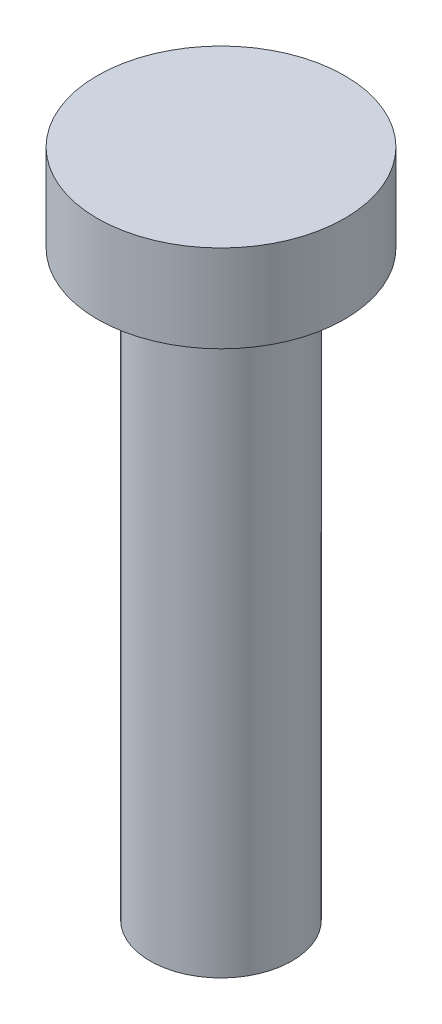
ISO-10303-21;
HEADER;
FILE_DESCRIPTION(('STEP AP214'),'2;1');
FILE_NAME('part.step','',(''),(''),'','','');
FILE_SCHEMA(('AUTOMOTIVE_DESIGN { 1 0 10303 214 1 1 1 1 }'));
ENDSEC;
DATA;
#1=APPLICATION_CONTEXT('core data for automotive mechanical design processes');
#2=APPLICATION_PROTOCOL_DEFINITION('international standard','automotive_design',2000,#1);
#3=PRODUCT_CONTEXT('',#1,'mechanical');
#4=PRODUCT('Part','Part','',(#3));
#5=PRODUCT_RELATED_PRODUCT_CATEGORY('part','',(#4));
#6=PRODUCT_DEFINITION_FORMATION('','',#4);
#7=PRODUCT_DEFINITION_CONTEXT('part definition',#1,'design');
#8=PRODUCT_DEFINITION('design','',#6,#7);
#9=PRODUCT_DEFINITION_SHAPE('','',#8);
#10=(LENGTH_UNIT() NAMED_UNIT(*) SI_UNIT(.MILLI.,.METRE.));
#11=(NAMED_UNIT(*) PLANE_ANGLE_UNIT() SI_UNIT($,.RADIAN.));
#12=(NAMED_UNIT(*) SI_UNIT($,.STERADIAN.) SOLID_ANGLE_UNIT());
#13=UNCERTAINTY_MEASURE_WITH_UNIT(LENGTH_MEASURE(1.E-05),#10,'distance_accuracy_value','');
#14=(GEOMETRIC_REPRESENTATION_CONTEXT(3) GLOBAL_UNCERTAINTY_ASSIGNED_CONTEXT((#13)) GLOBAL_UNIT_ASSIGNED_CONTEXT((#10,
#11,#12)) REPRESENTATION_CONTEXT('',''));
#15=CARTESIAN_POINT('',(0.,0.,0.));
#16=DIRECTION('',(0.,0.,1.));
#17=DIRECTION('',(1.,0.,0.));
#18=AXIS2_PLACEMENT_3D('',#15,#16,#17);
#19=CARTESIAN_POINT('',(0.,3.,0.));
#20=DIRECTION('',(0.,-1.,0.));
#21=DIRECTION('',(0.,0.,-1.));
#22=AXIS2_PLACEMENT_3D('',#19,#20,#21);
#23=CYLINDRICAL_SURFACE('',#22,4.25);
#24=CARTESIAN_POINT('',(0.,3.,0.));
#25=DIRECTION('',(0.,1.,0.));
#26=DIRECTION('',(0.,0.,1.));
#27=AXIS2_PLACEMENT_3D('',#24,#25,#26);
#28=CIRCLE('',#27,4.25);
#29=CARTESIAN_POINT('',(0.,3.,4.25));
#30=VERTEX_POINT('',#29);
#31=EDGE_CURVE('E39',#30,#30,#28,.T.);
#32=ORIENTED_EDGE('',*,*,#31,.F.);
#33=EDGE_LOOP('',(#32));
#34=FACE_BOUND('',#33,.T.);
#35=CARTESIAN_POINT('',(0.,0.,0.));
#36=DIRECTION('',(0.,1.,0.));
#37=DIRECTION('',(0.,0.,1.));
#38=AXIS2_PLACEMENT_3D('',#35,#36,#37);
#39=CIRCLE('',#38,4.25);
#40=CARTESIAN_POINT('',(0.,0.,4.25));
#41=VERTEX_POINT('',#40);
#42=EDGE_CURVE('E35',#41,#41,#39,.T.);
#43=ORIENTED_EDGE('',*,*,#42,.T.);
#44=EDGE_LOOP('',(#43));
#45=FACE_BOUND('',#44,.T.);
#46=ADVANCED_FACE('F32',(#34,#45),#23,.T.);
#47=CARTESIAN_POINT('',(0.,3.,0.));
#48=DIRECTION('',(0.,1.,0.));
#49=DIRECTION('',(0.,0.,1.));
#50=AXIS2_PLACEMENT_3D('',#47,#48,#49);
#51=PLANE('',#50);
#52=ORIENTED_EDGE('',*,*,#31,.T.);
#53=EDGE_LOOP('',(#52));
#54=FACE_BOUND('',#53,.T.);
#55=ADVANCED_FACE('F56',(#54),#51,.T.);
#56=CARTESIAN_POINT('',(0.,0.,0.));
#57=DIRECTION('',(0.,1.,0.));
#58=DIRECTION('',(0.,0.,1.));
#59=AXIS2_PLACEMENT_3D('',#56,#57,#58);
#60=PLANE('',#59);
#61=CARTESIAN_POINT('',(0.,0.,0.));
#62=DIRECTION('',(0.,-1.,0.));
#63=DIRECTION('',(0.,0.,-1.));
#64=AXIS2_PLACEMENT_3D('',#61,#62,#63);
#65=CIRCLE('',#64,2.44);
#66=CARTESIAN_POINT('',(0.,0.,-2.44));
#67=VERTEX_POINT('',#66);
#68=EDGE_CURVE('E10',#67,#67,#65,.T.);
#69=ORIENTED_EDGE('',*,*,#68,.F.);
#70=EDGE_LOOP('',(#69));
#71=FACE_BOUND('',#70,.T.);
#72=ORIENTED_EDGE('',*,*,#42,.F.);
#73=EDGE_LOOP('',(#72));
#74=FACE_BOUND('',#73,.T.);
#75=ADVANCED_FACE('F53',(#71,#74),#60,.F.);
#76=CARTESIAN_POINT('',(0.,-20.,0.));
#77=DIRECTION('',(0.,1.,0.));
#78=DIRECTION('',(0.,0.,1.));
#79=AXIS2_PLACEMENT_3D('',#76,#77,#78);
#80=CYLINDRICAL_SURFACE('',#79,2.44);
#81=CARTESIAN_POINT('',(0.,-20.,0.));
#82=DIRECTION('',(0.,-1.,0.));
#83=DIRECTION('',(0.,0.,-1.));
#84=AXIS2_PLACEMENT_3D('',#81,#82,#83);
#85=CIRCLE('',#84,2.44);
#86=CARTESIAN_POINT('',(0.,-20.,-2.44));
#87=VERTEX_POINT('',#86);
#88=EDGE_CURVE('E45',#87,#87,#85,.T.);
#89=ORIENTED_EDGE('',*,*,#88,.F.);
#90=EDGE_LOOP('',(#89));
#91=FACE_BOUND('',#90,.T.);
#92=ORIENTED_EDGE('',*,*,#68,.T.);
#93=EDGE_LOOP('',(#92));
#94=FACE_BOUND('',#93,.T.);
#95=ADVANCED_FACE('F55',(#91,#94),#80,.T.);
#96=CARTESIAN_POINT('',(0.,-20.,0.));
#97=DIRECTION('',(0.,-1.,0.));
#98=DIRECTION('',(0.,0.,-1.));
#99=AXIS2_PLACEMENT_3D('',#96,#97,#98);
#100=PLANE('',#99);
#101=ORIENTED_EDGE('',*,*,#88,.T.);
#102=EDGE_LOOP('',(#101));
#103=FACE_BOUND('',#102,.T.);
#104=ADVANCED_FACE('F62',(#103),#100,.T.);
#105=CLOSED_SHELL('',(#46,#55,#75,#95,#104));
#106=MANIFOLD_SOLID_BREP('B2',#105);
#107=ADVANCED_BREP_SHAPE_REPRESENTATION('',(#18,#106),#14);
#108=SHAPE_DEFINITION_REPRESENTATION(#9,#107);
ENDSEC;
END-ISO-10303-21;
